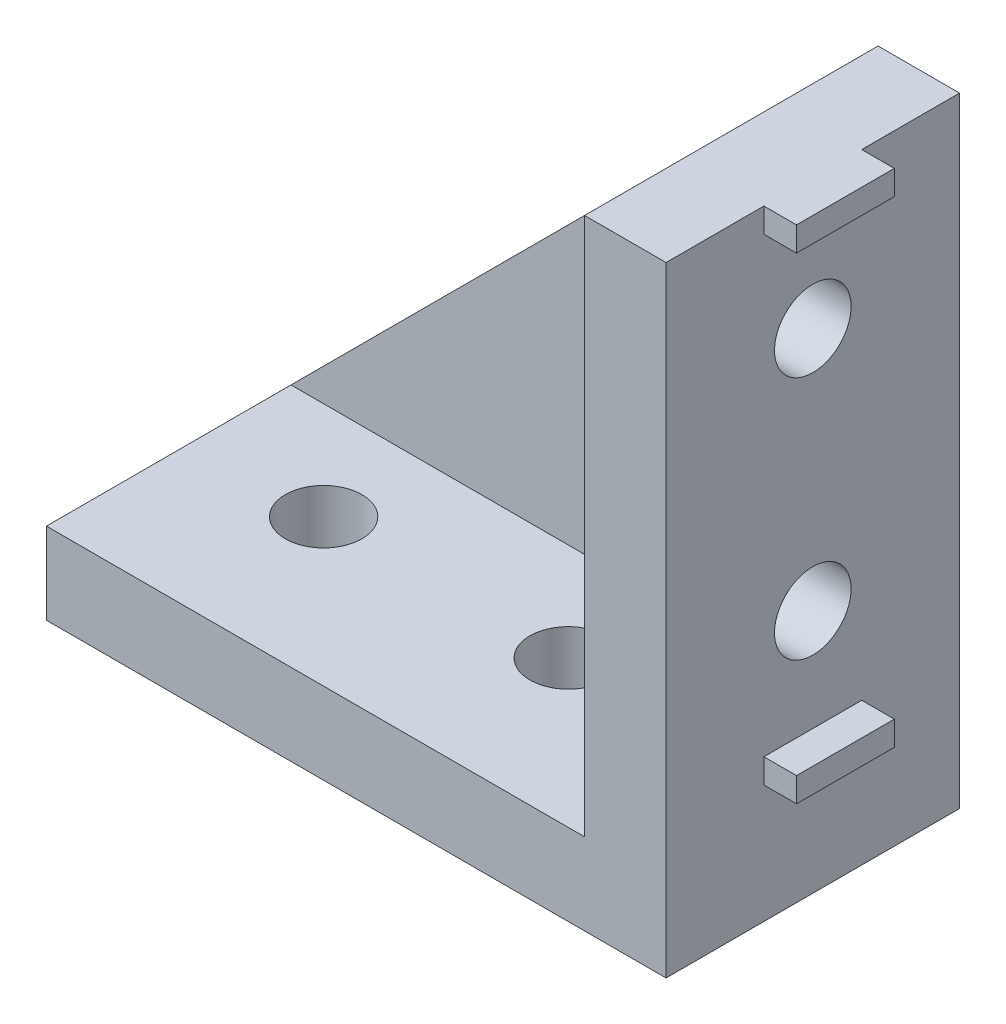
ISO-10303-21;
HEADER;
FILE_DESCRIPTION(('STEP AP214'),'2;1');
FILE_NAME('part.step','',(''),(''),'','','');
FILE_SCHEMA(('AUTOMOTIVE_DESIGN { 1 0 10303 214 1 1 1 1 }'));
ENDSEC;
DATA;
#1=APPLICATION_CONTEXT('core data for automotive mechanical design processes');
#2=APPLICATION_PROTOCOL_DEFINITION('international standard','automotive_design',2000,#1);
#3=PRODUCT_CONTEXT('',#1,'mechanical');
#4=PRODUCT('Part','Part','',(#3));
#5=PRODUCT_RELATED_PRODUCT_CATEGORY('part','',(#4));
#6=PRODUCT_DEFINITION_FORMATION('','',#4);
#7=PRODUCT_DEFINITION_CONTEXT('part definition',#1,'design');
#8=PRODUCT_DEFINITION('design','',#6,#7);
#9=PRODUCT_DEFINITION_SHAPE('','',#8);
#10=(LENGTH_UNIT() NAMED_UNIT(*) SI_UNIT(.MILLI.,.METRE.));
#11=(NAMED_UNIT(*) PLANE_ANGLE_UNIT() SI_UNIT($,.RADIAN.));
#12=(NAMED_UNIT(*) SI_UNIT($,.STERADIAN.) SOLID_ANGLE_UNIT());
#13=UNCERTAINTY_MEASURE_WITH_UNIT(LENGTH_MEASURE(1.E-05),#10,'distance_accuracy_value','');
#14=(GEOMETRIC_REPRESENTATION_CONTEXT(3) GLOBAL_UNCERTAINTY_ASSIGNED_CONTEXT((#13)) GLOBAL_UNIT_ASSIGNED_CONTEXT((#10,
#11,#12)) REPRESENTATION_CONTEXT('',''));
#15=CARTESIAN_POINT('',(0.,0.,0.));
#16=DIRECTION('',(0.,0.,1.));
#17=DIRECTION('',(1.,0.,0.));
#18=AXIS2_PLACEMENT_3D('',#15,#16,#17);
#19=CARTESIAN_POINT('',(-5.,4.99999999999999,18.));
#20=DIRECTION('',(1.,0.,0.));
#21=DIRECTION('',(0.,1.,0.));
#22=AXIS2_PLACEMENT_3D('',#19,#20,#21);
#23=PLANE('',#22);
#24=CARTESIAN_POINT('',(-5.,15.,9.));
#25=DIRECTION('',(1.,0.,0.));
#26=DIRECTION('',(0.,1.,0.));
#27=AXIS2_PLACEMENT_3D('',#24,#25,#26);
#28=CIRCLE('',#27,2.35);
#29=CARTESIAN_POINT('',(-5.,17.35,9.));
#30=VERTEX_POINT('',#29);
#31=EDGE_CURVE('E287',#30,#30,#28,.T.);
#32=ORIENTED_EDGE('',*,*,#31,.T.);
#33=EDGE_LOOP('',(#32));
#34=FACE_BOUND('',#33,.T.);
#35=CARTESIAN_POINT('',(-5.,30.,9.));
#36=DIRECTION('',(1.,0.,0.));
#37=DIRECTION('',(0.,1.,0.));
#38=AXIS2_PLACEMENT_3D('',#35,#36,#37);
#39=CIRCLE('',#38,2.35);
#40=CARTESIAN_POINT('',(-5.,32.35,9.));
#41=VERTEX_POINT('',#40);
#42=EDGE_CURVE('E288',#41,#41,#39,.T.);
#43=ORIENTED_EDGE('',*,*,#42,.T.);
#44=EDGE_LOOP('',(#43));
#45=FACE_BOUND('',#44,.T.);
#46=DIRECTION('',(0.,-1.,0.));
#47=VECTOR('',#46,1.);
#48=CARTESIAN_POINT('',(-5.,4.99999999999999,3.));
#49=LINE('',#48,#47);
#50=CARTESIAN_POINT('',(-5.,38.,3.));
#51=VERTEX_POINT('',#50);
#52=CARTESIAN_POINT('',(-5.,4.99999999999999,3.));
#53=VERTEX_POINT('',#52);
#54=EDGE_CURVE('E56',#51,#53,#49,.T.);
#55=ORIENTED_EDGE('',*,*,#54,.T.);
#56=DIRECTION('',(0.,0.,-1.));
#57=VECTOR('',#56,1.);
#58=CARTESIAN_POINT('',(-5.,4.99999999999999,18.));
#59=LINE('',#58,#57);
#60=CARTESIAN_POINT('',(-5.,4.99999999999999,18.));
#61=VERTEX_POINT('',#60);
#62=EDGE_CURVE('E394',#61,#53,#59,.T.);
#63=ORIENTED_EDGE('',*,*,#62,.F.);
#64=DIRECTION('',(0.,-1.,0.));
#65=VECTOR('',#64,1.);
#66=CARTESIAN_POINT('',(-5.,4.99999999999999,18.));
#67=LINE('',#66,#65);
#68=CARTESIAN_POINT('',(-5.,38.,18.));
#69=VERTEX_POINT('',#68);
#70=EDGE_CURVE('E374',#69,#61,#67,.T.);
#71=ORIENTED_EDGE('',*,*,#70,.F.);
#72=DIRECTION('',(0.,0.,-1.));
#73=VECTOR('',#72,1.);
#74=CARTESIAN_POINT('',(-5.,38.,18.));
#75=LINE('',#74,#73);
#76=EDGE_CURVE('E396',#69,#51,#75,.T.);
#77=ORIENTED_EDGE('',*,*,#76,.T.);
#78=EDGE_LOOP('',(#55,#63,#71,#77));
#79=FACE_BOUND('',#78,.T.);
#80=ADVANCED_FACE('F32',(#34,#45,#79),#23,.F.);
#81=CARTESIAN_POINT('',(-38.,5.,18.));
#82=DIRECTION('',(0.,-1.,0.));
#83=DIRECTION('',(1.,0.,0.));
#84=AXIS2_PLACEMENT_3D('',#81,#82,#83);
#85=PLANE('',#84);
#86=CARTESIAN_POINT('',(-15.,4.99999999999999,9.));
#87=DIRECTION('',(0.,1.,0.));
#88=DIRECTION('',(-1.,0.,0.));
#89=AXIS2_PLACEMENT_3D('',#86,#87,#88);
#90=CIRCLE('',#89,2.35);
#91=CARTESIAN_POINT('',(-17.35,4.99999999999999,9.));
#92=VERTEX_POINT('',#91);
#93=EDGE_CURVE('E362',#92,#92,#90,.T.);
#94=ORIENTED_EDGE('',*,*,#93,.F.);
#95=EDGE_LOOP('',(#94));
#96=FACE_BOUND('',#95,.T.);
#97=CARTESIAN_POINT('',(-30.,4.99999999999999,9.));
#98=DIRECTION('',(0.,1.,0.));
#99=DIRECTION('',(-1.,0.,0.));
#100=AXIS2_PLACEMENT_3D('',#97,#98,#99);
#101=CIRCLE('',#100,2.35);
#102=CARTESIAN_POINT('',(-32.35,4.99999999999999,9.));
#103=VERTEX_POINT('',#102);
#104=EDGE_CURVE('E363',#103,#103,#101,.T.);
#105=ORIENTED_EDGE('',*,*,#104,.F.);
#106=EDGE_LOOP('',(#105));
#107=FACE_BOUND('',#106,.T.);
#108=DIRECTION('',(-1.,0.,0.));
#109=VECTOR('',#108,1.);
#110=CARTESIAN_POINT('',(-38.,5.,3.));
#111=LINE('',#110,#109);
#112=CARTESIAN_POINT('',(-38.,5.,3.));
#113=VERTEX_POINT('',#112);
#114=EDGE_CURVE('E218',#53,#113,#111,.T.);
#115=ORIENTED_EDGE('',*,*,#114,.T.);
#116=DIRECTION('',(0.,0.,-1.));
#117=VECTOR('',#116,1.);
#118=CARTESIAN_POINT('',(-38.,5.,18.));
#119=LINE('',#118,#117);
#120=CARTESIAN_POINT('',(-38.,5.,18.));
#121=VERTEX_POINT('',#120);
#122=EDGE_CURVE('E210',#121,#113,#119,.T.);
#123=ORIENTED_EDGE('',*,*,#122,.F.);
#124=DIRECTION('',(-1.,0.,0.));
#125=VECTOR('',#124,1.);
#126=CARTESIAN_POINT('',(-38.,5.,18.));
#127=LINE('',#126,#125);
#128=EDGE_CURVE('E376',#61,#121,#127,.T.);
#129=ORIENTED_EDGE('',*,*,#128,.F.);
#130=ORIENTED_EDGE('',*,*,#62,.T.);
#131=EDGE_LOOP('',(#115,#123,#129,#130));
#132=FACE_BOUND('',#131,.T.);
#133=ADVANCED_FACE('F421',(#96,#107,#132),#85,.F.);
#134=CARTESIAN_POINT('',(0.,0.,18.));
#135=DIRECTION('',(0.,1.,0.));
#136=DIRECTION('',(-1.,0.,0.));
#137=AXIS2_PLACEMENT_3D('',#134,#135,#136);
#138=PLANE('',#137);
#139=DIRECTION('',(1.,0.,0.));
#140=VECTOR('',#139,1.);
#141=CARTESIAN_POINT('',(-38.,0.,5.99999999999998));
#142=LINE('',#141,#140);
#143=CARTESIAN_POINT('',(-38.,0.,5.99999999999998));
#144=VERTEX_POINT('',#143);
#145=CARTESIAN_POINT('',(-36.5,0.,5.99999999999998));
#146=VERTEX_POINT('',#145);
#147=EDGE_CURVE('E337',#144,#146,#142,.T.);
#148=ORIENTED_EDGE('',*,*,#147,.F.);
#149=DIRECTION('',(0.,0.,-1.));
#150=VECTOR('',#149,1.);
#151=CARTESIAN_POINT('',(-38.,0.,18.));
#152=LINE('',#151,#150);
#153=CARTESIAN_POINT('',(-38.,0.,0.));
#154=VERTEX_POINT('',#153);
#155=EDGE_CURVE('E390',#144,#154,#152,.T.);
#156=ORIENTED_EDGE('',*,*,#155,.T.);
#157=DIRECTION('',(1.,0.,0.));
#158=VECTOR('',#157,1.);
#159=CARTESIAN_POINT('',(0.,0.,0.));
#160=LINE('',#159,#158);
#161=CARTESIAN_POINT('',(0.,0.,0.));
#162=VERTEX_POINT('',#161);
#163=EDGE_CURVE('E199',#154,#162,#160,.T.);
#164=ORIENTED_EDGE('',*,*,#163,.T.);
#165=DIRECTION('',(0.,0.,-1.));
#166=VECTOR('',#165,1.);
#167=CARTESIAN_POINT('',(0.,0.,18.));
#168=LINE('',#167,#166);
#169=CARTESIAN_POINT('',(0.,0.,18.));
#170=VERTEX_POINT('',#169);
#171=EDGE_CURVE('E382',#170,#162,#168,.T.);
#172=ORIENTED_EDGE('',*,*,#171,.F.);
#173=DIRECTION('',(1.,0.,0.));
#174=VECTOR('',#173,1.);
#175=CARTESIAN_POINT('',(0.,0.,18.));
#176=LINE('',#175,#174);
#177=CARTESIAN_POINT('',(-38.,0.,18.));
#178=VERTEX_POINT('',#177);
#179=EDGE_CURVE('E380',#178,#170,#176,.T.);
#180=ORIENTED_EDGE('',*,*,#179,.F.);
#181=CARTESIAN_POINT('',(-38.,0.,12.));
#182=VERTEX_POINT('',#181);
#183=EDGE_CURVE('E391',#178,#182,#152,.T.);
#184=ORIENTED_EDGE('',*,*,#183,.T.);
#185=DIRECTION('',(-1.,0.,0.));
#186=VECTOR('',#185,1.);
#187=CARTESIAN_POINT('',(-38.,0.,12.));
#188=LINE('',#187,#186);
#189=CARTESIAN_POINT('',(-36.5,0.,12.));
#190=VERTEX_POINT('',#189);
#191=EDGE_CURVE('E346',#190,#182,#188,.T.);
#192=ORIENTED_EDGE('',*,*,#191,.F.);
#193=DIRECTION('',(0.,0.,1.));
#194=VECTOR('',#193,1.);
#195=CARTESIAN_POINT('',(-36.5,0.,5.99999999999998));
#196=LINE('',#195,#194);
#197=EDGE_CURVE('E332',#146,#190,#196,.T.);
#198=ORIENTED_EDGE('',*,*,#197,.F.);
#199=EDGE_LOOP('',(#148,#156,#164,#172,#180,#184,#192,#198));
#200=FACE_BOUND('',#199,.T.);
#201=CARTESIAN_POINT('',(-30.,0.,9.));
#202=DIRECTION('',(0.,1.,0.));
#203=DIRECTION('',(-1.,0.,0.));
#204=AXIS2_PLACEMENT_3D('',#201,#202,#203);
#205=CIRCLE('',#204,2.35);
#206=CARTESIAN_POINT('',(-32.35,0.,9.));
#207=VERTEX_POINT('',#206);
#208=EDGE_CURVE('E36',#207,#207,#205,.T.);
#209=ORIENTED_EDGE('',*,*,#208,.T.);
#210=EDGE_LOOP('',(#209));
#211=FACE_BOUND('',#210,.T.);
#212=CARTESIAN_POINT('',(-15.,0.,9.));
#213=DIRECTION('',(0.,1.,0.));
#214=DIRECTION('',(-1.,0.,0.));
#215=AXIS2_PLACEMENT_3D('',#212,#213,#214);
#216=CIRCLE('',#215,2.35);
#217=CARTESIAN_POINT('',(-17.35,0.,9.));
#218=VERTEX_POINT('',#217);
#219=EDGE_CURVE('E366',#218,#218,#216,.T.);
#220=ORIENTED_EDGE('',*,*,#219,.T.);
#221=EDGE_LOOP('',(#220));
#222=FACE_BOUND('',#221,.T.);
#223=DIRECTION('',(0.,0.,1.));
#224=VECTOR('',#223,1.);
#225=CARTESIAN_POINT('',(-7.25,0.,6.));
#226=LINE('',#225,#224);
#227=CARTESIAN_POINT('',(-7.25,0.,6.));
#228=VERTEX_POINT('',#227);
#229=CARTESIAN_POINT('',(-7.25,0.,12.));
#230=VERTEX_POINT('',#229);
#231=EDGE_CURVE('E299',#228,#230,#226,.T.);
#232=ORIENTED_EDGE('',*,*,#231,.F.);
#233=DIRECTION('',(1.,0.,0.));
#234=VECTOR('',#233,1.);
#235=CARTESIAN_POINT('',(-8.75,0.,6.));
#236=LINE('',#235,#234);
#237=CARTESIAN_POINT('',(-8.75,0.,6.));
#238=VERTEX_POINT('',#237);
#239=EDGE_CURVE('E304',#238,#228,#236,.T.);
#240=ORIENTED_EDGE('',*,*,#239,.F.);
#241=DIRECTION('',(0.,0.,-1.));
#242=VECTOR('',#241,1.);
#243=CARTESIAN_POINT('',(-8.75,0.,6.));
#244=LINE('',#243,#242);
#245=CARTESIAN_POINT('',(-8.75,0.,12.));
#246=VERTEX_POINT('',#245);
#247=EDGE_CURVE('E316',#246,#238,#244,.T.);
#248=ORIENTED_EDGE('',*,*,#247,.F.);
#249=DIRECTION('',(-1.,0.,0.));
#250=VECTOR('',#249,1.);
#251=CARTESIAN_POINT('',(-8.75,0.,12.));
#252=LINE('',#251,#250);
#253=EDGE_CURVE('E313',#230,#246,#252,.T.);
#254=ORIENTED_EDGE('',*,*,#253,.F.);
#255=EDGE_LOOP('',(#232,#240,#248,#254));
#256=FACE_BOUND('',#255,.T.);
#257=ADVANCED_FACE('F403',(#200,#211,#222,#256),#138,.F.);
#258=CARTESIAN_POINT('',(0.,38.,18.));
#259=DIRECTION('',(-1.,0.,0.));
#260=DIRECTION('',(0.,-1.,0.));
#261=AXIS2_PLACEMENT_3D('',#258,#259,#260);
#262=PLANE('',#261);
#263=DIRECTION('',(0.,-1.,0.));
#264=VECTOR('',#263,1.);
#265=CARTESIAN_POINT('',(0.,8.75,6.));
#266=LINE('',#265,#264);
#267=CARTESIAN_POINT('',(0.,8.75,6.));
#268=VERTEX_POINT('',#267);
#269=CARTESIAN_POINT('',(0.,7.25,6.));
#270=VERTEX_POINT('',#269);
#271=EDGE_CURVE('E241',#268,#270,#266,.T.);
#272=ORIENTED_EDGE('',*,*,#271,.T.);
#273=DIRECTION('',(0.,0.,1.));
#274=VECTOR('',#273,1.);
#275=CARTESIAN_POINT('',(0.,7.25,6.));
#276=LINE('',#275,#274);
#277=CARTESIAN_POINT('',(0.,7.25,12.));
#278=VERTEX_POINT('',#277);
#279=EDGE_CURVE('E223',#270,#278,#276,.T.);
#280=ORIENTED_EDGE('',*,*,#279,.T.);
#281=DIRECTION('',(0.,1.,0.));
#282=VECTOR('',#281,1.);
#283=CARTESIAN_POINT('',(0.,8.75,12.));
#284=LINE('',#283,#282);
#285=CARTESIAN_POINT('',(0.,8.75,12.));
#286=VERTEX_POINT('',#285);
#287=EDGE_CURVE('E229',#278,#286,#284,.T.);
#288=ORIENTED_EDGE('',*,*,#287,.T.);
#289=DIRECTION('',(0.,0.,-1.));
#290=VECTOR('',#289,1.);
#291=CARTESIAN_POINT('',(0.,8.75,6.));
#292=LINE('',#291,#290);
#293=EDGE_CURVE('E244',#286,#268,#292,.T.);
#294=ORIENTED_EDGE('',*,*,#293,.T.);
#295=EDGE_LOOP('',(#272,#280,#288,#294));
#296=FACE_BOUND('',#295,.T.);
#297=CARTESIAN_POINT('',(0.,30.,9.));
#298=DIRECTION('',(-1.,0.,0.));
#299=DIRECTION('',(0.,-1.,0.));
#300=AXIS2_PLACEMENT_3D('',#297,#298,#299);
#301=CIRCLE('',#300,2.35);
#302=CARTESIAN_POINT('',(0.,27.65,9.));
#303=VERTEX_POINT('',#302);
#304=EDGE_CURVE('E296',#303,#303,#301,.F.);
#305=ORIENTED_EDGE('',*,*,#304,.F.);
#306=EDGE_LOOP('',(#305));
#307=FACE_BOUND('',#306,.T.);
#308=CARTESIAN_POINT('',(0.,15.,9.));
#309=DIRECTION('',(-1.,0.,0.));
#310=DIRECTION('',(0.,-1.,0.));
#311=AXIS2_PLACEMENT_3D('',#308,#309,#310);
#312=CIRCLE('',#311,2.35);
#313=CARTESIAN_POINT('',(0.,12.65,9.));
#314=VERTEX_POINT('',#313);
#315=EDGE_CURVE('E291',#314,#314,#312,.F.);
#316=ORIENTED_EDGE('',*,*,#315,.F.);
#317=EDGE_LOOP('',(#316));
#318=FACE_BOUND('',#317,.T.);
#319=DIRECTION('',(0.,0.,1.));
#320=VECTOR('',#319,1.);
#321=CARTESIAN_POINT('',(0.,36.5,5.99999999999998));
#322=LINE('',#321,#320);
#323=CARTESIAN_POINT('',(0.,36.5,5.99999999999998));
#324=VERTEX_POINT('',#323);
#325=CARTESIAN_POINT('',(0.,36.5,12.));
#326=VERTEX_POINT('',#325);
#327=EDGE_CURVE('E257',#324,#326,#322,.T.);
#328=ORIENTED_EDGE('',*,*,#327,.T.);
#329=DIRECTION('',(0.,1.,0.));
#330=VECTOR('',#329,1.);
#331=CARTESIAN_POINT('',(0.,38.,12.));
#332=LINE('',#331,#330);
#333=CARTESIAN_POINT('',(0.,38.,12.));
#334=VERTEX_POINT('',#333);
#335=EDGE_CURVE('E262',#326,#334,#332,.T.);
#336=ORIENTED_EDGE('',*,*,#335,.T.);
#337=DIRECTION('',(0.,0.,-1.));
#338=VECTOR('',#337,1.);
#339=CARTESIAN_POINT('',(0.,38.,18.));
#340=LINE('',#339,#338);
#341=CARTESIAN_POINT('',(0.,38.,18.));
#342=VERTEX_POINT('',#341);
#343=EDGE_CURVE('E11',#342,#334,#340,.T.);
#344=ORIENTED_EDGE('',*,*,#343,.F.);
#345=DIRECTION('',(0.,1.,0.));
#346=VECTOR('',#345,1.);
#347=CARTESIAN_POINT('',(0.,38.,18.));
#348=LINE('',#347,#346);
#349=EDGE_CURVE('E369',#170,#342,#348,.T.);
#350=ORIENTED_EDGE('',*,*,#349,.F.);
#351=ORIENTED_EDGE('',*,*,#171,.T.);
#352=DIRECTION('',(0.,1.,0.));
#353=VECTOR('',#352,1.);
#354=CARTESIAN_POINT('',(0.,38.,0.));
#355=LINE('',#354,#353);
#356=CARTESIAN_POINT('',(0.,38.,0.));
#357=VERTEX_POINT('',#356);
#358=EDGE_CURVE('E383',#162,#357,#355,.T.);
#359=ORIENTED_EDGE('',*,*,#358,.T.);
#360=CARTESIAN_POINT('',(0.,38.,5.99999999999998));
#361=VERTEX_POINT('',#360);
#362=EDGE_CURVE('E41',#361,#357,#340,.T.);
#363=ORIENTED_EDGE('',*,*,#362,.F.);
#364=DIRECTION('',(0.,-1.,0.));
#365=VECTOR('',#364,1.);
#366=CARTESIAN_POINT('',(0.,38.,5.99999999999998));
#367=LINE('',#366,#365);
#368=EDGE_CURVE('E274',#361,#324,#367,.T.);
#369=ORIENTED_EDGE('',*,*,#368,.T.);
#370=EDGE_LOOP('',(#328,#336,#344,#350,#351,#359,#363,#369));
#371=FACE_BOUND('',#370,.T.);
#372=ADVANCED_FACE('F34',(#296,#307,#318,#371),#262,.F.);
#373=CARTESIAN_POINT('',(-5.,38.,18.));
#374=DIRECTION('',(0.,-1.,0.));
#375=DIRECTION('',(0.,0.,-1.));
#376=AXIS2_PLACEMENT_3D('',#373,#374,#375);
#377=PLANE('',#376);
#378=DIRECTION('',(-1.,0.,0.));
#379=VECTOR('',#378,1.);
#380=CARTESIAN_POINT('',(-5.,38.,0.));
#381=LINE('',#380,#379);
#382=CARTESIAN_POINT('',(-5.,38.,0.));
#383=VERTEX_POINT('',#382);
#384=EDGE_CURVE('E202',#357,#383,#381,.T.);
#385=ORIENTED_EDGE('',*,*,#384,.T.);
#386=DIRECTION('',(0.,0.,-1.));
#387=VECTOR('',#386,1.);
#388=CARTESIAN_POINT('',(-5.,38.,3.));
#389=LINE('',#388,#387);
#390=EDGE_CURVE('E49',#51,#383,#389,.T.);
#391=ORIENTED_EDGE('',*,*,#390,.F.);
#392=ORIENTED_EDGE('',*,*,#76,.F.);
#393=DIRECTION('',(-1.,0.,0.));
#394=VECTOR('',#393,1.);
#395=CARTESIAN_POINT('',(-5.,38.,18.));
#396=LINE('',#395,#394);
#397=EDGE_CURVE('E372',#342,#69,#396,.T.);
#398=ORIENTED_EDGE('',*,*,#397,.F.);
#399=ORIENTED_EDGE('',*,*,#343,.T.);
#400=DIRECTION('',(-1.,0.,0.));
#401=VECTOR('',#400,1.);
#402=CARTESIAN_POINT('',(2.,38.,12.));
#403=LINE('',#402,#401);
#404=CARTESIAN_POINT('',(2.,38.,12.));
#405=VERTEX_POINT('',#404);
#406=EDGE_CURVE('E280',#405,#334,#403,.T.);
#407=ORIENTED_EDGE('',*,*,#406,.F.);
#408=DIRECTION('',(0.,0.,-1.));
#409=VECTOR('',#408,1.);
#410=CARTESIAN_POINT('',(2.,38.,5.99999999999998));
#411=LINE('',#410,#409);
#412=CARTESIAN_POINT('',(2.,38.,5.99999999999998));
#413=VERTEX_POINT('',#412);
#414=EDGE_CURVE('E265',#405,#413,#411,.T.);
#415=ORIENTED_EDGE('',*,*,#414,.T.);
#416=DIRECTION('',(-1.,0.,0.));
#417=VECTOR('',#416,1.);
#418=CARTESIAN_POINT('',(2.,38.,5.99999999999998));
#419=LINE('',#418,#417);
#420=EDGE_CURVE('E282',#413,#361,#419,.T.);
#421=ORIENTED_EDGE('',*,*,#420,.T.);
#422=ORIENTED_EDGE('',*,*,#362,.T.);
#423=EDGE_LOOP('',(#385,#391,#392,#398,#399,#407,#415,#421,#422));
#424=FACE_BOUND('',#423,.T.);
#425=ADVANCED_FACE('F431',(#424),#377,.F.);
#426=CARTESIAN_POINT('',(-38.,0.,18.));
#427=DIRECTION('',(1.,0.,0.));
#428=DIRECTION('',(0.,0.,-1.));
#429=AXIS2_PLACEMENT_3D('',#426,#427,#428);
#430=PLANE('',#429);
#431=DIRECTION('',(0.,-1.,0.));
#432=VECTOR('',#431,1.);
#433=CARTESIAN_POINT('',(-38.,0.,0.));
#434=LINE('',#433,#432);
#435=CARTESIAN_POINT('',(-38.,5.,0.));
#436=VERTEX_POINT('',#435);
#437=EDGE_CURVE('E192',#436,#154,#434,.T.);
#438=ORIENTED_EDGE('',*,*,#437,.T.);
#439=ORIENTED_EDGE('',*,*,#155,.F.);
#440=DIRECTION('',(0.,1.,0.));
#441=VECTOR('',#440,1.);
#442=CARTESIAN_POINT('',(-38.,-2.,5.99999999999998));
#443=LINE('',#442,#441);
#444=CARTESIAN_POINT('',(-38.,-2.,5.99999999999998));
#445=VERTEX_POINT('',#444);
#446=EDGE_CURVE('E353',#445,#144,#443,.T.);
#447=ORIENTED_EDGE('',*,*,#446,.F.);
#448=DIRECTION('',(0.,0.,-1.));
#449=VECTOR('',#448,1.);
#450=CARTESIAN_POINT('',(-38.,-2.,5.99999999999998));
#451=LINE('',#450,#449);
#452=CARTESIAN_POINT('',(-38.,-2.,12.));
#453=VERTEX_POINT('',#452);
#454=EDGE_CURVE('E339',#453,#445,#451,.T.);
#455=ORIENTED_EDGE('',*,*,#454,.F.);
#456=DIRECTION('',(0.,1.,0.));
#457=VECTOR('',#456,1.);
#458=CARTESIAN_POINT('',(-38.,-2.,12.));
#459=LINE('',#458,#457);
#460=EDGE_CURVE('E356',#453,#182,#459,.T.);
#461=ORIENTED_EDGE('',*,*,#460,.T.);
#462=ORIENTED_EDGE('',*,*,#183,.F.);
#463=DIRECTION('',(0.,-1.,0.));
#464=VECTOR('',#463,1.);
#465=CARTESIAN_POINT('',(-38.,0.,18.));
#466=LINE('',#465,#464);
#467=EDGE_CURVE('E378',#121,#178,#466,.T.);
#468=ORIENTED_EDGE('',*,*,#467,.F.);
#469=ORIENTED_EDGE('',*,*,#122,.T.);
#470=DIRECTION('',(0.,0.,-1.));
#471=VECTOR('',#470,1.);
#472=CARTESIAN_POINT('',(-38.,5.,3.));
#473=LINE('',#472,#471);
#474=EDGE_CURVE('E206',#113,#436,#473,.T.);
#475=ORIENTED_EDGE('',*,*,#474,.T.);
#476=EDGE_LOOP('',(#438,#439,#447,#455,#461,#462,#468,#469,#475));
#477=FACE_BOUND('',#476,.T.);
#478=ADVANCED_FACE('F207',(#477),#430,.F.);
#479=CARTESIAN_POINT('',(0.,0.,18.));
#480=DIRECTION('',(0.,0.,-1.));
#481=DIRECTION('',(-1.,0.,0.));
#482=AXIS2_PLACEMENT_3D('',#479,#480,#481);
#483=PLANE('',#482);
#484=ORIENTED_EDGE('',*,*,#349,.T.);
#485=ORIENTED_EDGE('',*,*,#397,.T.);
#486=ORIENTED_EDGE('',*,*,#70,.T.);
#487=ORIENTED_EDGE('',*,*,#128,.T.);
#488=ORIENTED_EDGE('',*,*,#467,.T.);
#489=ORIENTED_EDGE('',*,*,#179,.T.);
#490=EDGE_LOOP('',(#484,#485,#486,#487,#488,#489));
#491=FACE_BOUND('',#490,.T.);
#492=ADVANCED_FACE('F437',(#491),#483,.F.);
#493=CARTESIAN_POINT('',(0.,0.,0.));
#494=DIRECTION('',(0.,0.,-1.));
#495=DIRECTION('',(-1.,0.,0.));
#496=AXIS2_PLACEMENT_3D('',#493,#494,#495);
#497=PLANE('',#496);
#498=ORIENTED_EDGE('',*,*,#358,.F.);
#499=ORIENTED_EDGE('',*,*,#163,.F.);
#500=ORIENTED_EDGE('',*,*,#437,.F.);
#501=DIRECTION('',(0.707106781186547,0.707106781186547,0.));
#502=VECTOR('',#501,1.);
#503=CARTESIAN_POINT('',(-5.,38.,0.));
#504=LINE('',#503,#502);
#505=EDGE_CURVE('E198',#436,#383,#504,.T.);
#506=ORIENTED_EDGE('',*,*,#505,.T.);
#507=ORIENTED_EDGE('',*,*,#384,.F.);
#508=EDGE_LOOP('',(#498,#499,#500,#506,#507));
#509=FACE_BOUND('',#508,.T.);
#510=ADVANCED_FACE('F195',(#509),#497,.T.);
#511=CARTESIAN_POINT('',(-15.,-13.,9.));
#512=DIRECTION('',(0.,1.,0.));
#513=DIRECTION('',(-1.,0.,0.));
#514=AXIS2_PLACEMENT_3D('',#511,#512,#513);
#515=CYLINDRICAL_SURFACE('',#514,2.35);
#516=ORIENTED_EDGE('',*,*,#93,.T.);
#517=EDGE_LOOP('',(#516));
#518=FACE_BOUND('',#517,.T.);
#519=ORIENTED_EDGE('',*,*,#219,.F.);
#520=EDGE_LOOP('',(#519));
#521=FACE_BOUND('',#520,.T.);
#522=ADVANCED_FACE('F408',(#518,#521),#515,.F.);
#523=CARTESIAN_POINT('',(-30.,-13.,9.));
#524=DIRECTION('',(0.,1.,0.));
#525=DIRECTION('',(-1.,0.,0.));
#526=AXIS2_PLACEMENT_3D('',#523,#524,#525);
#527=CYLINDRICAL_SURFACE('',#526,2.35);
#528=ORIENTED_EDGE('',*,*,#104,.T.);
#529=EDGE_LOOP('',(#528));
#530=FACE_BOUND('',#529,.T.);
#531=ORIENTED_EDGE('',*,*,#208,.F.);
#532=EDGE_LOOP('',(#531));
#533=FACE_BOUND('',#532,.T.);
#534=ADVANCED_FACE('F405',(#530,#533),#527,.F.);
#535=CARTESIAN_POINT('',(-36.5,-2.,5.99999999999998));
#536=DIRECTION('',(-1.,0.,0.));
#537=DIRECTION('',(0.,-1.,0.));
#538=AXIS2_PLACEMENT_3D('',#535,#536,#537);
#539=PLANE('',#538);
#540=ORIENTED_EDGE('',*,*,#197,.T.);
#541=DIRECTION('',(0.,1.,0.));
#542=VECTOR('',#541,1.);
#543=CARTESIAN_POINT('',(-36.5,-2.,12.));
#544=LINE('',#543,#542);
#545=CARTESIAN_POINT('',(-36.5,-2.,12.));
#546=VERTEX_POINT('',#545);
#547=EDGE_CURVE('E359',#546,#190,#544,.T.);
#548=ORIENTED_EDGE('',*,*,#547,.F.);
#549=DIRECTION('',(0.,0.,1.));
#550=VECTOR('',#549,1.);
#551=CARTESIAN_POINT('',(-36.5,-2.,5.99999999999998));
#552=LINE('',#551,#550);
#553=CARTESIAN_POINT('',(-36.5,-2.,5.99999999999998));
#554=VERTEX_POINT('',#553);
#555=EDGE_CURVE('E333',#554,#546,#552,.T.);
#556=ORIENTED_EDGE('',*,*,#555,.F.);
#557=DIRECTION('',(0.,1.,0.));
#558=VECTOR('',#557,1.);
#559=CARTESIAN_POINT('',(-36.5,-2.,5.99999999999998));
#560=LINE('',#559,#558);
#561=EDGE_CURVE('E343',#554,#146,#560,.T.);
#562=ORIENTED_EDGE('',*,*,#561,.T.);
#563=EDGE_LOOP('',(#540,#548,#556,#562));
#564=FACE_BOUND('',#563,.T.);
#565=ADVANCED_FACE('F407',(#564),#539,.F.);
#566=CARTESIAN_POINT('',(-38.,-2.,12.));
#567=DIRECTION('',(0.,0.,-1.));
#568=DIRECTION('',(-1.,0.,0.));
#569=AXIS2_PLACEMENT_3D('',#566,#567,#568);
#570=PLANE('',#569);
#571=ORIENTED_EDGE('',*,*,#191,.T.);
#572=ORIENTED_EDGE('',*,*,#460,.F.);
#573=DIRECTION('',(-1.,0.,0.));
#574=VECTOR('',#573,1.);
#575=CARTESIAN_POINT('',(-38.,-2.,12.));
#576=LINE('',#575,#574);
#577=EDGE_CURVE('E336',#546,#453,#576,.T.);
#578=ORIENTED_EDGE('',*,*,#577,.F.);
#579=ORIENTED_EDGE('',*,*,#547,.T.);
#580=EDGE_LOOP('',(#571,#572,#578,#579));
#581=FACE_BOUND('',#580,.T.);
#582=ADVANCED_FACE('F415',(#581),#570,.F.);
#583=CARTESIAN_POINT('',(-38.,-2.,5.99999999999998));
#584=DIRECTION('',(0.,0.,1.));
#585=DIRECTION('',(1.,0.,0.));
#586=AXIS2_PLACEMENT_3D('',#583,#584,#585);
#587=PLANE('',#586);
#588=ORIENTED_EDGE('',*,*,#147,.T.);
#589=ORIENTED_EDGE('',*,*,#561,.F.);
#590=DIRECTION('',(1.,0.,0.));
#591=VECTOR('',#590,1.);
#592=CARTESIAN_POINT('',(-38.,-2.,5.99999999999998));
#593=LINE('',#592,#591);
#594=EDGE_CURVE('E341',#445,#554,#593,.T.);
#595=ORIENTED_EDGE('',*,*,#594,.F.);
#596=ORIENTED_EDGE('',*,*,#446,.T.);
#597=EDGE_LOOP('',(#588,#589,#595,#596));
#598=FACE_BOUND('',#597,.T.);
#599=ADVANCED_FACE('F450',(#598),#587,.F.);
#600=CARTESIAN_POINT('',(0.,-2.,0.));
#601=DIRECTION('',(0.,1.,0.));
#602=DIRECTION('',(-1.,0.,0.));
#603=AXIS2_PLACEMENT_3D('',#600,#601,#602);
#604=PLANE('',#603);
#605=ORIENTED_EDGE('',*,*,#555,.T.);
#606=ORIENTED_EDGE('',*,*,#577,.T.);
#607=ORIENTED_EDGE('',*,*,#454,.T.);
#608=ORIENTED_EDGE('',*,*,#594,.T.);
#609=EDGE_LOOP('',(#605,#606,#607,#608));
#610=FACE_BOUND('',#609,.T.);
#611=ADVANCED_FACE('F454',(#610),#604,.F.);
#612=CARTESIAN_POINT('',(-7.25,-2.,6.));
#613=DIRECTION('',(-1.,0.,0.));
#614=DIRECTION('',(0.,-1.,0.));
#615=AXIS2_PLACEMENT_3D('',#612,#613,#614);
#616=PLANE('',#615);
#617=ORIENTED_EDGE('',*,*,#231,.T.);
#618=DIRECTION('',(0.,1.,0.));
#619=VECTOR('',#618,1.);
#620=CARTESIAN_POINT('',(-7.25,-2.,12.));
#621=LINE('',#620,#619);
#622=CARTESIAN_POINT('',(-7.25,-2.,12.));
#623=VERTEX_POINT('',#622);
#624=EDGE_CURVE('E329',#623,#230,#621,.T.);
#625=ORIENTED_EDGE('',*,*,#624,.F.);
#626=DIRECTION('',(0.,0.,1.));
#627=VECTOR('',#626,1.);
#628=CARTESIAN_POINT('',(-7.25,-2.,6.));
#629=LINE('',#628,#627);
#630=CARTESIAN_POINT('',(-7.25,-2.,6.));
#631=VERTEX_POINT('',#630);
#632=EDGE_CURVE('E300',#631,#623,#629,.T.);
#633=ORIENTED_EDGE('',*,*,#632,.F.);
#634=DIRECTION('',(0.,1.,0.));
#635=VECTOR('',#634,1.);
#636=CARTESIAN_POINT('',(-7.25,-2.,6.));
#637=LINE('',#636,#635);
#638=EDGE_CURVE('E310',#631,#228,#637,.T.);
#639=ORIENTED_EDGE('',*,*,#638,.T.);
#640=EDGE_LOOP('',(#617,#625,#633,#639));
#641=FACE_BOUND('',#640,.T.);
#642=ADVANCED_FACE('F468',(#641),#616,.F.);
#643=CARTESIAN_POINT('',(-8.75,-2.,12.));
#644=DIRECTION('',(0.,0.,-1.));
#645=DIRECTION('',(-1.,0.,0.));
#646=AXIS2_PLACEMENT_3D('',#643,#644,#645);
#647=PLANE('',#646);
#648=ORIENTED_EDGE('',*,*,#253,.T.);
#649=DIRECTION('',(0.,1.,0.));
#650=VECTOR('',#649,1.);
#651=CARTESIAN_POINT('',(-8.75,-2.,12.));
#652=LINE('',#651,#650);
#653=CARTESIAN_POINT('',(-8.75,-2.,12.));
#654=VERTEX_POINT('',#653);
#655=EDGE_CURVE('E326',#654,#246,#652,.T.);
#656=ORIENTED_EDGE('',*,*,#655,.F.);
#657=DIRECTION('',(-1.,0.,0.));
#658=VECTOR('',#657,1.);
#659=CARTESIAN_POINT('',(-8.75,-2.,12.));
#660=LINE('',#659,#658);
#661=EDGE_CURVE('E303',#623,#654,#660,.T.);
#662=ORIENTED_EDGE('',*,*,#661,.F.);
#663=ORIENTED_EDGE('',*,*,#624,.T.);
#664=EDGE_LOOP('',(#648,#656,#662,#663));
#665=FACE_BOUND('',#664,.T.);
#666=ADVANCED_FACE('F471',(#665),#647,.F.);
#667=CARTESIAN_POINT('',(-8.75,-2.,6.));
#668=DIRECTION('',(1.,0.,0.));
#669=DIRECTION('',(0.,1.,0.));
#670=AXIS2_PLACEMENT_3D('',#667,#668,#669);
#671=PLANE('',#670);
#672=ORIENTED_EDGE('',*,*,#247,.T.);
#673=DIRECTION('',(0.,1.,0.));
#674=VECTOR('',#673,1.);
#675=CARTESIAN_POINT('',(-8.75,-2.,6.));
#676=LINE('',#675,#674);
#677=CARTESIAN_POINT('',(-8.75,-2.,6.));
#678=VERTEX_POINT('',#677);
#679=EDGE_CURVE('E323',#678,#238,#676,.T.);
#680=ORIENTED_EDGE('',*,*,#679,.F.);
#681=DIRECTION('',(0.,0.,-1.));
#682=VECTOR('',#681,1.);
#683=CARTESIAN_POINT('',(-8.75,-2.,6.));
#684=LINE('',#683,#682);
#685=EDGE_CURVE('E306',#654,#678,#684,.T.);
#686=ORIENTED_EDGE('',*,*,#685,.F.);
#687=ORIENTED_EDGE('',*,*,#655,.T.);
#688=EDGE_LOOP('',(#672,#680,#686,#687));
#689=FACE_BOUND('',#688,.T.);
#690=ADVANCED_FACE('F475',(#689),#671,.F.);
#691=CARTESIAN_POINT('',(-8.75,-2.,6.));
#692=DIRECTION('',(0.,0.,1.));
#693=DIRECTION('',(1.,0.,0.));
#694=AXIS2_PLACEMENT_3D('',#691,#692,#693);
#695=PLANE('',#694);
#696=ORIENTED_EDGE('',*,*,#239,.T.);
#697=ORIENTED_EDGE('',*,*,#638,.F.);
#698=DIRECTION('',(1.,0.,0.));
#699=VECTOR('',#698,1.);
#700=CARTESIAN_POINT('',(-8.75,-2.,6.));
#701=LINE('',#700,#699);
#702=EDGE_CURVE('E308',#678,#631,#701,.T.);
#703=ORIENTED_EDGE('',*,*,#702,.F.);
#704=ORIENTED_EDGE('',*,*,#679,.T.);
#705=EDGE_LOOP('',(#696,#697,#703,#704));
#706=FACE_BOUND('',#705,.T.);
#707=ADVANCED_FACE('F479',(#706),#695,.F.);
#708=CARTESIAN_POINT('',(0.,-2.,0.));
#709=DIRECTION('',(0.,1.,0.));
#710=DIRECTION('',(-1.,0.,0.));
#711=AXIS2_PLACEMENT_3D('',#708,#709,#710);
#712=PLANE('',#711);
#713=ORIENTED_EDGE('',*,*,#632,.T.);
#714=ORIENTED_EDGE('',*,*,#661,.T.);
#715=ORIENTED_EDGE('',*,*,#685,.T.);
#716=ORIENTED_EDGE('',*,*,#702,.T.);
#717=EDGE_LOOP('',(#713,#714,#715,#716));
#718=FACE_BOUND('',#717,.T.);
#719=ADVANCED_FACE('F483',(#718),#712,.F.);
#720=CARTESIAN_POINT('',(13.,15.,9.));
#721=DIRECTION('',(-1.,0.,0.));
#722=DIRECTION('',(0.,-1.,0.));
#723=AXIS2_PLACEMENT_3D('',#720,#721,#722);
#724=CYLINDRICAL_SURFACE('',#723,2.35);
#725=ORIENTED_EDGE('',*,*,#31,.F.);
#726=EDGE_LOOP('',(#725));
#727=FACE_BOUND('',#726,.T.);
#728=ORIENTED_EDGE('',*,*,#315,.T.);
#729=EDGE_LOOP('',(#728));
#730=FACE_BOUND('',#729,.T.);
#731=ADVANCED_FACE('F487',(#727,#730),#724,.F.);
#732=CARTESIAN_POINT('',(13.,30.,9.));
#733=DIRECTION('',(-1.,0.,0.));
#734=DIRECTION('',(0.,-1.,0.));
#735=AXIS2_PLACEMENT_3D('',#732,#733,#734);
#736=CYLINDRICAL_SURFACE('',#735,2.35);
#737=ORIENTED_EDGE('',*,*,#42,.F.);
#738=EDGE_LOOP('',(#737));
#739=FACE_BOUND('',#738,.T.);
#740=ORIENTED_EDGE('',*,*,#304,.T.);
#741=EDGE_LOOP('',(#740));
#742=FACE_BOUND('',#741,.T.);
#743=ADVANCED_FACE('F491',(#739,#742),#736,.F.);
#744=CARTESIAN_POINT('',(2.,36.5,5.99999999999998));
#745=DIRECTION('',(0.,-1.,0.));
#746=DIRECTION('',(1.,0.,0.));
#747=AXIS2_PLACEMENT_3D('',#744,#745,#746);
#748=PLANE('',#747);
#749=ORIENTED_EDGE('',*,*,#327,.F.);
#750=DIRECTION('',(-1.,0.,0.));
#751=VECTOR('',#750,1.);
#752=CARTESIAN_POINT('',(2.,36.5,5.99999999999998));
#753=LINE('',#752,#751);
#754=CARTESIAN_POINT('',(2.,36.5,5.99999999999998));
#755=VERTEX_POINT('',#754);
#756=EDGE_CURVE('E284',#755,#324,#753,.T.);
#757=ORIENTED_EDGE('',*,*,#756,.F.);
#758=DIRECTION('',(0.,0.,1.));
#759=VECTOR('',#758,1.);
#760=CARTESIAN_POINT('',(2.,36.5,5.99999999999998));
#761=LINE('',#760,#759);
#762=CARTESIAN_POINT('',(2.,36.5,12.));
#763=VERTEX_POINT('',#762);
#764=EDGE_CURVE('E258',#755,#763,#761,.T.);
#765=ORIENTED_EDGE('',*,*,#764,.T.);
#766=DIRECTION('',(-1.,0.,0.));
#767=VECTOR('',#766,1.);
#768=CARTESIAN_POINT('',(2.,36.5,12.));
#769=LINE('',#768,#767);
#770=EDGE_CURVE('E271',#763,#326,#769,.T.);
#771=ORIENTED_EDGE('',*,*,#770,.T.);
#772=EDGE_LOOP('',(#749,#757,#765,#771));
#773=FACE_BOUND('',#772,.T.);
#774=ADVANCED_FACE('F495',(#773),#748,.T.);
#775=CARTESIAN_POINT('',(2.,38.,5.99999999999998));
#776=DIRECTION('',(0.,0.,-1.));
#777=DIRECTION('',(-1.,0.,0.));
#778=AXIS2_PLACEMENT_3D('',#775,#776,#777);
#779=PLANE('',#778);
#780=ORIENTED_EDGE('',*,*,#368,.F.);
#781=ORIENTED_EDGE('',*,*,#420,.F.);
#782=DIRECTION('',(0.,-1.,0.));
#783=VECTOR('',#782,1.);
#784=CARTESIAN_POINT('',(2.,38.,5.99999999999998));
#785=LINE('',#784,#783);
#786=EDGE_CURVE('E261',#413,#755,#785,.T.);
#787=ORIENTED_EDGE('',*,*,#786,.T.);
#788=ORIENTED_EDGE('',*,*,#756,.T.);
#789=EDGE_LOOP('',(#780,#781,#787,#788));
#790=FACE_BOUND('',#789,.T.);
#791=ADVANCED_FACE('F499',(#790),#779,.T.);
#792=CARTESIAN_POINT('',(2.,38.,12.));
#793=DIRECTION('',(0.,0.,1.));
#794=DIRECTION('',(1.,0.,0.));
#795=AXIS2_PLACEMENT_3D('',#792,#793,#794);
#796=PLANE('',#795);
#797=ORIENTED_EDGE('',*,*,#335,.F.);
#798=ORIENTED_EDGE('',*,*,#770,.F.);
#799=DIRECTION('',(0.,1.,0.));
#800=VECTOR('',#799,1.);
#801=CARTESIAN_POINT('',(2.,38.,12.));
#802=LINE('',#801,#800);
#803=EDGE_CURVE('E268',#763,#405,#802,.T.);
#804=ORIENTED_EDGE('',*,*,#803,.T.);
#805=ORIENTED_EDGE('',*,*,#406,.T.);
#806=EDGE_LOOP('',(#797,#798,#804,#805));
#807=FACE_BOUND('',#806,.T.);
#808=ADVANCED_FACE('F503',(#807),#796,.T.);
#809=CARTESIAN_POINT('',(2.,0.,0.));
#810=DIRECTION('',(-1.,0.,0.));
#811=DIRECTION('',(0.,1.,0.));
#812=AXIS2_PLACEMENT_3D('',#809,#810,#811);
#813=PLANE('',#812);
#814=ORIENTED_EDGE('',*,*,#764,.F.);
#815=ORIENTED_EDGE('',*,*,#786,.F.);
#816=ORIENTED_EDGE('',*,*,#414,.F.);
#817=ORIENTED_EDGE('',*,*,#803,.F.);
#818=EDGE_LOOP('',(#814,#815,#816,#817));
#819=FACE_BOUND('',#818,.T.);
#820=ADVANCED_FACE('F507',(#819),#813,.F.);
#821=CARTESIAN_POINT('',(2.,7.25,6.));
#822=DIRECTION('',(0.,-1.,0.));
#823=DIRECTION('',(1.,0.,0.));
#824=AXIS2_PLACEMENT_3D('',#821,#822,#823);
#825=PLANE('',#824);
#826=ORIENTED_EDGE('',*,*,#279,.F.);
#827=DIRECTION('',(-1.,0.,0.));
#828=VECTOR('',#827,1.);
#829=CARTESIAN_POINT('',(2.,7.25,6.));
#830=LINE('',#829,#828);
#831=CARTESIAN_POINT('',(2.,7.25,6.));
#832=VERTEX_POINT('',#831);
#833=EDGE_CURVE('E255',#832,#270,#830,.T.);
#834=ORIENTED_EDGE('',*,*,#833,.F.);
#835=DIRECTION('',(0.,0.,1.));
#836=VECTOR('',#835,1.);
#837=CARTESIAN_POINT('',(2.,7.25,6.));
#838=LINE('',#837,#836);
#839=CARTESIAN_POINT('',(2.,7.25,12.));
#840=VERTEX_POINT('',#839);
#841=EDGE_CURVE('E225',#832,#840,#838,.T.);
#842=ORIENTED_EDGE('',*,*,#841,.T.);
#843=DIRECTION('',(-1.,0.,0.));
#844=VECTOR('',#843,1.);
#845=CARTESIAN_POINT('',(2.,7.25,12.));
#846=LINE('',#845,#844);
#847=EDGE_CURVE('E238',#840,#278,#846,.T.);
#848=ORIENTED_EDGE('',*,*,#847,.T.);
#849=EDGE_LOOP('',(#826,#834,#842,#848));
#850=FACE_BOUND('',#849,.T.);
#851=ADVANCED_FACE('F511',(#850),#825,.T.);
#852=CARTESIAN_POINT('',(2.,8.75,6.));
#853=DIRECTION('',(0.,0.,-1.));
#854=DIRECTION('',(-1.,0.,0.));
#855=AXIS2_PLACEMENT_3D('',#852,#853,#854);
#856=PLANE('',#855);
#857=ORIENTED_EDGE('',*,*,#271,.F.);
#858=DIRECTION('',(-1.,0.,0.));
#859=VECTOR('',#858,1.);
#860=CARTESIAN_POINT('',(2.,8.75,6.));
#861=LINE('',#860,#859);
#862=CARTESIAN_POINT('',(2.,8.75,6.));
#863=VERTEX_POINT('',#862);
#864=EDGE_CURVE('E253',#863,#268,#861,.T.);
#865=ORIENTED_EDGE('',*,*,#864,.F.);
#866=DIRECTION('',(0.,-1.,0.));
#867=VECTOR('',#866,1.);
#868=CARTESIAN_POINT('',(2.,8.75,6.));
#869=LINE('',#868,#867);
#870=EDGE_CURVE('E228',#863,#832,#869,.T.);
#871=ORIENTED_EDGE('',*,*,#870,.T.);
#872=ORIENTED_EDGE('',*,*,#833,.T.);
#873=EDGE_LOOP('',(#857,#865,#871,#872));
#874=FACE_BOUND('',#873,.T.);
#875=ADVANCED_FACE('F515',(#874),#856,.T.);
#876=CARTESIAN_POINT('',(2.,8.75,6.));
#877=DIRECTION('',(0.,1.,0.));
#878=DIRECTION('',(-1.,0.,0.));
#879=AXIS2_PLACEMENT_3D('',#876,#877,#878);
#880=PLANE('',#879);
#881=ORIENTED_EDGE('',*,*,#293,.F.);
#882=DIRECTION('',(-1.,0.,0.));
#883=VECTOR('',#882,1.);
#884=CARTESIAN_POINT('',(2.,8.75,12.));
#885=LINE('',#884,#883);
#886=CARTESIAN_POINT('',(2.,8.75,12.));
#887=VERTEX_POINT('',#886);
#888=EDGE_CURVE('E250',#887,#286,#885,.T.);
#889=ORIENTED_EDGE('',*,*,#888,.F.);
#890=DIRECTION('',(0.,0.,-1.));
#891=VECTOR('',#890,1.);
#892=CARTESIAN_POINT('',(2.,8.75,6.));
#893=LINE('',#892,#891);
#894=EDGE_CURVE('E232',#887,#863,#893,.T.);
#895=ORIENTED_EDGE('',*,*,#894,.T.);
#896=ORIENTED_EDGE('',*,*,#864,.T.);
#897=EDGE_LOOP('',(#881,#889,#895,#896));
#898=FACE_BOUND('',#897,.T.);
#899=ADVANCED_FACE('F519',(#898),#880,.T.);
#900=CARTESIAN_POINT('',(2.,8.75,12.));
#901=DIRECTION('',(0.,0.,1.));
#902=DIRECTION('',(1.,0.,0.));
#903=AXIS2_PLACEMENT_3D('',#900,#901,#902);
#904=PLANE('',#903);
#905=ORIENTED_EDGE('',*,*,#287,.F.);
#906=ORIENTED_EDGE('',*,*,#847,.F.);
#907=DIRECTION('',(0.,1.,0.));
#908=VECTOR('',#907,1.);
#909=CARTESIAN_POINT('',(2.,8.75,12.));
#910=LINE('',#909,#908);
#911=EDGE_CURVE('E235',#840,#887,#910,.T.);
#912=ORIENTED_EDGE('',*,*,#911,.T.);
#913=ORIENTED_EDGE('',*,*,#888,.T.);
#914=EDGE_LOOP('',(#905,#906,#912,#913));
#915=FACE_BOUND('',#914,.T.);
#916=ADVANCED_FACE('F523',(#915),#904,.T.);
#917=CARTESIAN_POINT('',(2.,0.,0.));
#918=DIRECTION('',(-1.,0.,0.));
#919=DIRECTION('',(0.,1.,0.));
#920=AXIS2_PLACEMENT_3D('',#917,#918,#919);
#921=PLANE('',#920);
#922=ORIENTED_EDGE('',*,*,#841,.F.);
#923=ORIENTED_EDGE('',*,*,#870,.F.);
#924=ORIENTED_EDGE('',*,*,#894,.F.);
#925=ORIENTED_EDGE('',*,*,#911,.F.);
#926=EDGE_LOOP('',(#922,#923,#924,#925));
#927=FACE_BOUND('',#926,.T.);
#928=ADVANCED_FACE('F527',(#927),#921,.F.);
#929=CARTESIAN_POINT('',(-5.,38.,3.));
#930=DIRECTION('',(-0.707106781186548,0.707106781186548,0.));
#931=DIRECTION('',(-0.707106781186548,-0.707106781186548,0.));
#932=AXIS2_PLACEMENT_3D('',#929,#930,#931);
#933=PLANE('',#932);
#934=ORIENTED_EDGE('',*,*,#505,.F.);
#935=ORIENTED_EDGE('',*,*,#474,.F.);
#936=DIRECTION('',(0.707106781186547,0.707106781186547,0.));
#937=VECTOR('',#936,1.);
#938=CARTESIAN_POINT('',(-5.,38.,3.));
#939=LINE('',#938,#937);
#940=EDGE_CURVE('E214',#113,#51,#939,.T.);
#941=ORIENTED_EDGE('',*,*,#940,.T.);
#942=ORIENTED_EDGE('',*,*,#390,.T.);
#943=EDGE_LOOP('',(#934,#935,#941,#942));
#944=FACE_BOUND('',#943,.T.);
#945=ADVANCED_FACE('F216',(#944),#933,.T.);
#946=CARTESIAN_POINT('',(0.,0.,3.));
#947=DIRECTION('',(0.,0.,-1.));
#948=DIRECTION('',(-1.,0.,0.));
#949=AXIS2_PLACEMENT_3D('',#946,#947,#948);
#950=PLANE('',#949);
#951=ORIENTED_EDGE('',*,*,#54,.F.);
#952=ORIENTED_EDGE('',*,*,#940,.F.);
#953=ORIENTED_EDGE('',*,*,#114,.F.);
#954=EDGE_LOOP('',(#951,#952,#953));
#955=FACE_BOUND('',#954,.T.);
#956=ADVANCED_FACE('F534',(#955),#950,.F.);
#957=CLOSED_SHELL('',(#80,#133,#257,#372,#425,#478,#492,#510,#522,#534,#565,#582,#599,#611,#642,
#666,#690,#707,#719,#731,#743,#774,#791,#808,#820,#851,#875,#899,#916,#928,#945,#956));
#958=MANIFOLD_SOLID_BREP('B2',#957);
#959=ADVANCED_BREP_SHAPE_REPRESENTATION('',(#18,#958),#14);
#960=SHAPE_DEFINITION_REPRESENTATION(#9,#959);
ENDSEC;
END-ISO-10303-21;
